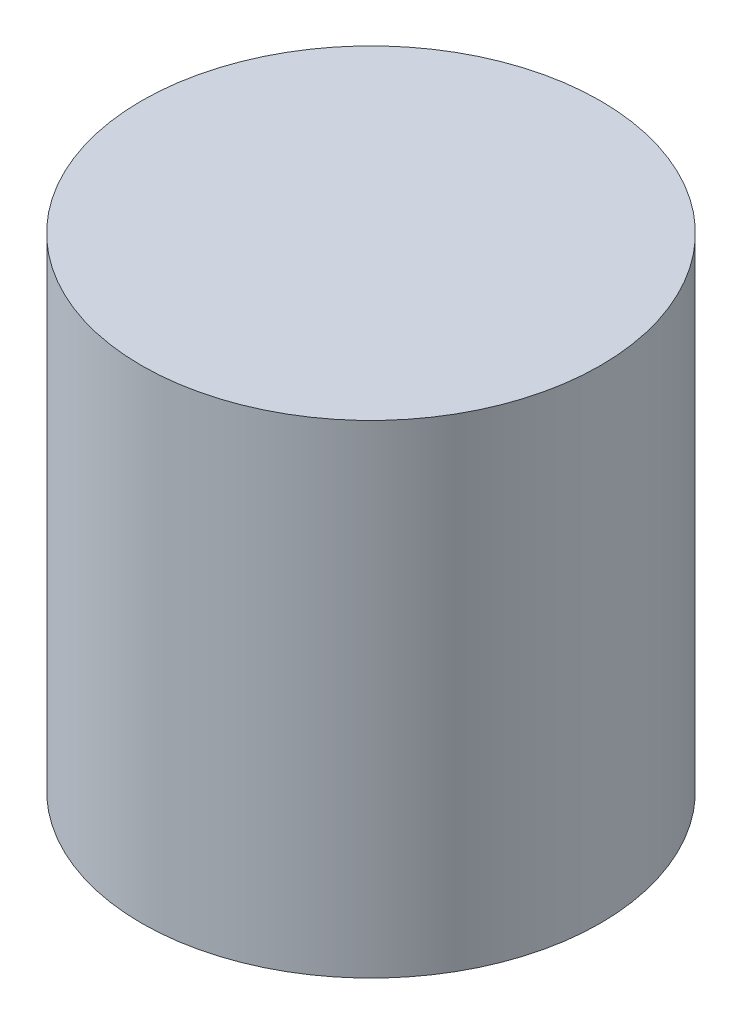
ISO-10303-21;
HEADER;
FILE_DESCRIPTION(('STEP AP214'),'2;1');
FILE_NAME('part.step','',(''),(''),'','','');
FILE_SCHEMA(('AUTOMOTIVE_DESIGN { 1 0 10303 214 1 1 1 1 }'));
ENDSEC;
DATA;
#1=APPLICATION_CONTEXT('core data for automotive mechanical design processes');
#2=APPLICATION_PROTOCOL_DEFINITION('international standard','automotive_design',2000,#1);
#3=PRODUCT_CONTEXT('',#1,'mechanical');
#4=PRODUCT('Part','Part','',(#3));
#5=PRODUCT_RELATED_PRODUCT_CATEGORY('part','',(#4));
#6=PRODUCT_DEFINITION_FORMATION('','',#4);
#7=PRODUCT_DEFINITION_CONTEXT('part definition',#1,'design');
#8=PRODUCT_DEFINITION('design','',#6,#7);
#9=PRODUCT_DEFINITION_SHAPE('','',#8);
#10=(LENGTH_UNIT() NAMED_UNIT(*) SI_UNIT(.MILLI.,.METRE.));
#11=(NAMED_UNIT(*) PLANE_ANGLE_UNIT() SI_UNIT($,.RADIAN.));
#12=(NAMED_UNIT(*) SI_UNIT($,.STERADIAN.) SOLID_ANGLE_UNIT());
#13=UNCERTAINTY_MEASURE_WITH_UNIT(LENGTH_MEASURE(1.E-05),#10,'distance_accuracy_value','');
#14=(GEOMETRIC_REPRESENTATION_CONTEXT(3) GLOBAL_UNCERTAINTY_ASSIGNED_CONTEXT((#13)) GLOBAL_UNIT_ASSIGNED_CONTEXT((#10,
#11,#12)) REPRESENTATION_CONTEXT('',''));
#15=CARTESIAN_POINT('',(0.,0.,0.));
#16=DIRECTION('',(0.,0.,1.));
#17=DIRECTION('',(1.,0.,0.));
#18=AXIS2_PLACEMENT_3D('',#15,#16,#17);
#19=CARTESIAN_POINT('',(-78.989108214343,50.8,92.5261108588505));
#20=DIRECTION('',(0.,-1.,0.));
#21=DIRECTION('',(0.,0.,-1.));
#22=AXIS2_PLACEMENT_3D('',#19,#20,#21);
#23=CYLINDRICAL_SURFACE('',#22,24.13);
#24=CARTESIAN_POINT('',(-78.989108214343,50.8,92.5261108588505));
#25=DIRECTION('',(0.,1.,0.));
#26=DIRECTION('',(0.,0.,1.));
#27=AXIS2_PLACEMENT_3D('',#24,#25,#26);
#28=CIRCLE('',#27,24.13);
#29=CARTESIAN_POINT('',(-78.989108214343,50.8,116.656110858851));
#30=VERTEX_POINT('',#29);
#31=EDGE_CURVE('E10',#30,#30,#28,.T.);
#32=ORIENTED_EDGE('',*,*,#31,.F.);
#33=EDGE_LOOP('',(#32));
#34=FACE_BOUND('',#33,.T.);
#35=CARTESIAN_POINT('',(-78.989108214343,0.,92.5261108588505));
#36=DIRECTION('',(0.,1.,0.));
#37=DIRECTION('',(0.,0.,1.));
#38=AXIS2_PLACEMENT_3D('',#35,#36,#37);
#39=CIRCLE('',#38,24.13);
#40=CARTESIAN_POINT('',(-78.989108214343,0.,116.656110858851));
#41=VERTEX_POINT('',#40);
#42=EDGE_CURVE('E34',#41,#41,#39,.T.);
#43=ORIENTED_EDGE('',*,*,#42,.T.);
#44=EDGE_LOOP('',(#43));
#45=FACE_BOUND('',#44,.T.);
#46=ADVANCED_FACE('F31',(#34,#45),#23,.T.);
#47=CARTESIAN_POINT('',(-78.989108214343,50.8,92.5261108588505));
#48=DIRECTION('',(0.,1.,0.));
#49=DIRECTION('',(0.,0.,1.));
#50=AXIS2_PLACEMENT_3D('',#47,#48,#49);
#51=PLANE('',#50);
#52=ORIENTED_EDGE('',*,*,#31,.T.);
#53=EDGE_LOOP('',(#52));
#54=FACE_BOUND('',#53,.T.);
#55=ADVANCED_FACE('F46',(#54),#51,.T.);
#56=CARTESIAN_POINT('',(-78.989108214343,0.,92.5261108588505));
#57=DIRECTION('',(0.,1.,0.));
#58=DIRECTION('',(0.,0.,1.));
#59=AXIS2_PLACEMENT_3D('',#56,#57,#58);
#60=PLANE('',#59);
#61=ORIENTED_EDGE('',*,*,#42,.F.);
#62=EDGE_LOOP('',(#61));
#63=FACE_BOUND('',#62,.T.);
#64=ADVANCED_FACE('F44',(#63),#60,.F.);
#65=CLOSED_SHELL('',(#46,#55,#64));
#66=MANIFOLD_SOLID_BREP('B2',#65);
#67=ADVANCED_BREP_SHAPE_REPRESENTATION('',(#18,#66),#14);
#68=SHAPE_DEFINITION_REPRESENTATION(#9,#67);
ENDSEC;
END-ISO-10303-21;
